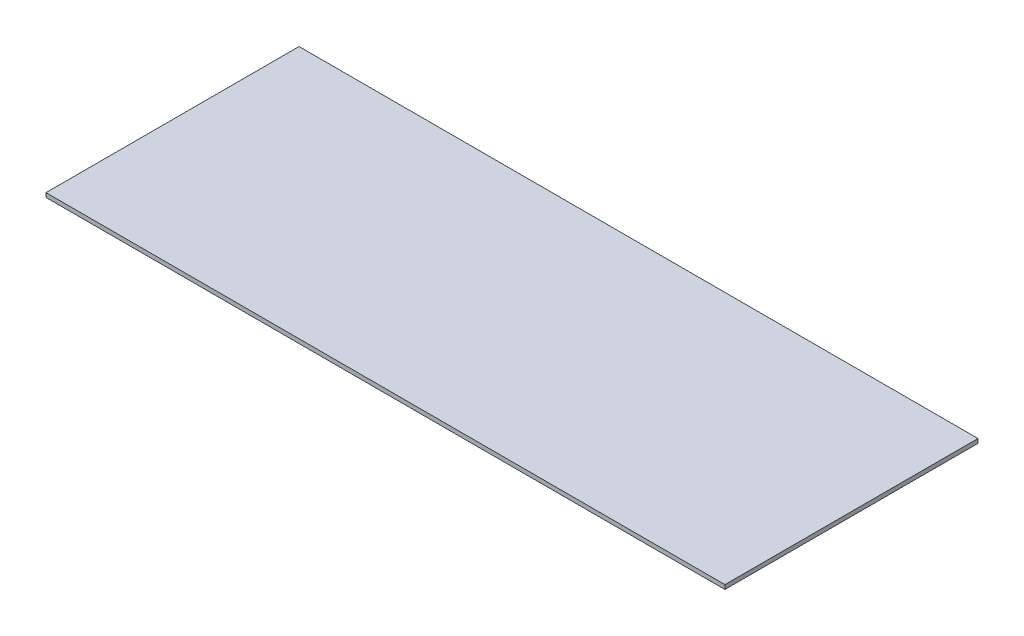
ISO-10303-21;
HEADER;
FILE_DESCRIPTION(('STEP AP214'),'2;1');
FILE_NAME('part.step','',(''),(''),'','','');
FILE_SCHEMA(('AUTOMOTIVE_DESIGN { 1 0 10303 214 1 1 1 1 }'));
ENDSEC;
DATA;
#1=APPLICATION_CONTEXT('core data for automotive mechanical design processes');
#2=APPLICATION_PROTOCOL_DEFINITION('international standard','automotive_design',2000,#1);
#3=PRODUCT_CONTEXT('',#1,'mechanical');
#4=PRODUCT('Part','Part','',(#3));
#5=PRODUCT_RELATED_PRODUCT_CATEGORY('part','',(#4));
#6=PRODUCT_DEFINITION_FORMATION('','',#4);
#7=PRODUCT_DEFINITION_CONTEXT('part definition',#1,'design');
#8=PRODUCT_DEFINITION('design','',#6,#7);
#9=PRODUCT_DEFINITION_SHAPE('','',#8);
#10=(LENGTH_UNIT() NAMED_UNIT(*) SI_UNIT(.MILLI.,.METRE.));
#11=(NAMED_UNIT(*) PLANE_ANGLE_UNIT() SI_UNIT($,.RADIAN.));
#12=(NAMED_UNIT(*) SI_UNIT($,.STERADIAN.) SOLID_ANGLE_UNIT());
#13=UNCERTAINTY_MEASURE_WITH_UNIT(LENGTH_MEASURE(1.E-05),#10,'distance_accuracy_value','');
#14=(GEOMETRIC_REPRESENTATION_CONTEXT(3) GLOBAL_UNCERTAINTY_ASSIGNED_CONTEXT((#13)) GLOBAL_UNIT_ASSIGNED_CONTEXT((#10,
#11,#12)) REPRESENTATION_CONTEXT('',''));
#15=CARTESIAN_POINT('',(0.,0.,0.));
#16=DIRECTION('',(0.,0.,1.));
#17=DIRECTION('',(1.,0.,0.));
#18=AXIS2_PLACEMENT_3D('',#15,#16,#17);
#19=CARTESIAN_POINT('',(-165.123577072762,3.,0.));
#20=DIRECTION('',(1.,0.,0.));
#21=DIRECTION('',(0.,0.,-1.));
#22=AXIS2_PLACEMENT_3D('',#19,#20,#21);
#23=PLANE('',#22);
#24=DIRECTION('',(0.,0.,1.));
#25=VECTOR('',#24,1.);
#26=CARTESIAN_POINT('',(-165.123577072762,0.,0.));
#27=LINE('',#26,#25);
#28=CARTESIAN_POINT('',(-165.123577072762,0.,-181.));
#29=VERTEX_POINT('',#28);
#30=CARTESIAN_POINT('',(-165.123577072762,0.,0.));
#31=VERTEX_POINT('',#30);
#32=EDGE_CURVE('E96',#29,#31,#27,.T.);
#33=ORIENTED_EDGE('',*,*,#32,.T.);
#34=DIRECTION('',(0.,-1.,0.));
#35=VECTOR('',#34,1.);
#36=CARTESIAN_POINT('',(-165.123577072762,3.,0.));
#37=LINE('',#36,#35);
#38=CARTESIAN_POINT('',(-165.123577072762,3.,0.));
#39=VERTEX_POINT('',#38);
#40=EDGE_CURVE('E11',#39,#31,#37,.T.);
#41=ORIENTED_EDGE('',*,*,#40,.F.);
#42=DIRECTION('',(0.,0.,1.));
#43=VECTOR('',#42,1.);
#44=CARTESIAN_POINT('',(-165.123577072762,3.,0.));
#45=LINE('',#44,#43);
#46=CARTESIAN_POINT('',(-165.123577072762,3.,-181.));
#47=VERTEX_POINT('',#46);
#48=EDGE_CURVE('E84',#47,#39,#45,.T.);
#49=ORIENTED_EDGE('',*,*,#48,.F.);
#50=DIRECTION('',(0.,-1.,0.));
#51=VECTOR('',#50,1.);
#52=CARTESIAN_POINT('',(-165.123577072762,3.,-181.));
#53=LINE('',#52,#51);
#54=EDGE_CURVE('E92',#47,#29,#53,.T.);
#55=ORIENTED_EDGE('',*,*,#54,.T.);
#56=EDGE_LOOP('',(#33,#41,#49,#55));
#57=FACE_BOUND('',#56,.T.);
#58=ADVANCED_FACE('F33',(#57),#23,.F.);
#59=CARTESIAN_POINT('',(-165.123577072762,3.,0.));
#60=DIRECTION('',(0.,0.,-1.));
#61=DIRECTION('',(-1.,0.,0.));
#62=AXIS2_PLACEMENT_3D('',#59,#60,#61);
#63=PLANE('',#62);
#64=DIRECTION('',(1.,0.,0.));
#65=VECTOR('',#64,1.);
#66=CARTESIAN_POINT('',(-165.123577072762,0.,0.));
#67=LINE('',#66,#65);
#68=CARTESIAN_POINT('',(320.459016393443,0.,0.));
#69=VERTEX_POINT('',#68);
#70=EDGE_CURVE('E88',#31,#69,#67,.T.);
#71=ORIENTED_EDGE('',*,*,#70,.T.);
#72=DIRECTION('',(0.,-1.,0.));
#73=VECTOR('',#72,1.);
#74=CARTESIAN_POINT('',(320.459016393443,3.,0.));
#75=LINE('',#74,#73);
#76=CARTESIAN_POINT('',(320.459016393443,3.,0.));
#77=VERTEX_POINT('',#76);
#78=EDGE_CURVE('E41',#77,#69,#75,.T.);
#79=ORIENTED_EDGE('',*,*,#78,.F.);
#80=DIRECTION('',(1.,0.,0.));
#81=VECTOR('',#80,1.);
#82=CARTESIAN_POINT('',(-165.123577072762,3.,0.));
#83=LINE('',#82,#81);
#84=EDGE_CURVE('E79',#39,#77,#83,.T.);
#85=ORIENTED_EDGE('',*,*,#84,.F.);
#86=ORIENTED_EDGE('',*,*,#40,.T.);
#87=EDGE_LOOP('',(#71,#79,#85,#86));
#88=FACE_BOUND('',#87,.T.);
#89=ADVANCED_FACE('F87',(#88),#63,.F.);
#90=CARTESIAN_POINT('',(320.459016393443,3.,0.));
#91=DIRECTION('',(-1.,0.,0.));
#92=DIRECTION('',(0.,0.,1.));
#93=AXIS2_PLACEMENT_3D('',#90,#91,#92);
#94=PLANE('',#93);
#95=DIRECTION('',(0.,0.,-1.));
#96=VECTOR('',#95,1.);
#97=CARTESIAN_POINT('',(320.459016393443,0.,0.));
#98=LINE('',#97,#96);
#99=CARTESIAN_POINT('',(320.459016393443,0.,-181.));
#100=VERTEX_POINT('',#99);
#101=EDGE_CURVE('E66',#69,#100,#98,.T.);
#102=ORIENTED_EDGE('',*,*,#101,.T.);
#103=DIRECTION('',(0.,-1.,0.));
#104=VECTOR('',#103,1.);
#105=CARTESIAN_POINT('',(320.459016393443,3.,-181.));
#106=LINE('',#105,#104);
#107=CARTESIAN_POINT('',(320.459016393443,3.,-181.));
#108=VERTEX_POINT('',#107);
#109=EDGE_CURVE('E89',#108,#100,#106,.T.);
#110=ORIENTED_EDGE('',*,*,#109,.F.);
#111=DIRECTION('',(0.,0.,-1.));
#112=VECTOR('',#111,1.);
#113=CARTESIAN_POINT('',(320.459016393443,3.,0.));
#114=LINE('',#113,#112);
#115=EDGE_CURVE('E82',#77,#108,#114,.T.);
#116=ORIENTED_EDGE('',*,*,#115,.F.);
#117=ORIENTED_EDGE('',*,*,#78,.T.);
#118=EDGE_LOOP('',(#102,#110,#116,#117));
#119=FACE_BOUND('',#118,.T.);
#120=ADVANCED_FACE('F90',(#119),#94,.F.);
#121=CARTESIAN_POINT('',(-165.123577072762,3.,-181.));
#122=DIRECTION('',(0.,0.,1.));
#123=DIRECTION('',(1.,0.,0.));
#124=AXIS2_PLACEMENT_3D('',#121,#122,#123);
#125=PLANE('',#124);
#126=DIRECTION('',(-1.,0.,0.));
#127=VECTOR('',#126,1.);
#128=CARTESIAN_POINT('',(-165.123577072762,0.,-181.));
#129=LINE('',#128,#127);
#130=EDGE_CURVE('E72',#100,#29,#129,.T.);
#131=ORIENTED_EDGE('',*,*,#130,.T.);
#132=ORIENTED_EDGE('',*,*,#54,.F.);
#133=DIRECTION('',(-1.,0.,0.));
#134=VECTOR('',#133,1.);
#135=CARTESIAN_POINT('',(-165.123577072762,3.,-181.));
#136=LINE('',#135,#134);
#137=EDGE_CURVE('E49',#108,#47,#136,.T.);
#138=ORIENTED_EDGE('',*,*,#137,.F.);
#139=ORIENTED_EDGE('',*,*,#109,.T.);
#140=EDGE_LOOP('',(#131,#132,#138,#139));
#141=FACE_BOUND('',#140,.T.);
#142=ADVANCED_FACE('F103',(#141),#125,.F.);
#143=CARTESIAN_POINT('',(0.,3.,0.));
#144=DIRECTION('',(0.,-1.,0.));
#145=DIRECTION('',(0.,0.,-1.));
#146=AXIS2_PLACEMENT_3D('',#143,#144,#145);
#147=PLANE('',#146);
#148=ORIENTED_EDGE('',*,*,#48,.T.);
#149=ORIENTED_EDGE('',*,*,#84,.T.);
#150=ORIENTED_EDGE('',*,*,#115,.T.);
#151=ORIENTED_EDGE('',*,*,#137,.T.);
#152=EDGE_LOOP('',(#148,#149,#150,#151));
#153=FACE_BOUND('',#152,.T.);
#154=ADVANCED_FACE('F80',(#153),#147,.F.);
#155=CARTESIAN_POINT('',(0.,0.,0.));
#156=DIRECTION('',(0.,-1.,0.));
#157=DIRECTION('',(0.,0.,-1.));
#158=AXIS2_PLACEMENT_3D('',#155,#156,#157);
#159=PLANE('',#158);
#160=ORIENTED_EDGE('',*,*,#32,.F.);
#161=ORIENTED_EDGE('',*,*,#130,.F.);
#162=ORIENTED_EDGE('',*,*,#101,.F.);
#163=ORIENTED_EDGE('',*,*,#70,.F.);
#164=EDGE_LOOP('',(#160,#161,#162,#163));
#165=FACE_BOUND('',#164,.T.);
#166=ADVANCED_FACE('F106',(#165),#159,.T.);
#167=CLOSED_SHELL('',(#58,#89,#120,#142,#154,#166));
#168=MANIFOLD_SOLID_BREP('B2',#167);
#169=ADVANCED_BREP_SHAPE_REPRESENTATION('',(#18,#168),#14);
#170=SHAPE_DEFINITION_REPRESENTATION(#9,#169);
ENDSEC;
END-ISO-10303-21;
